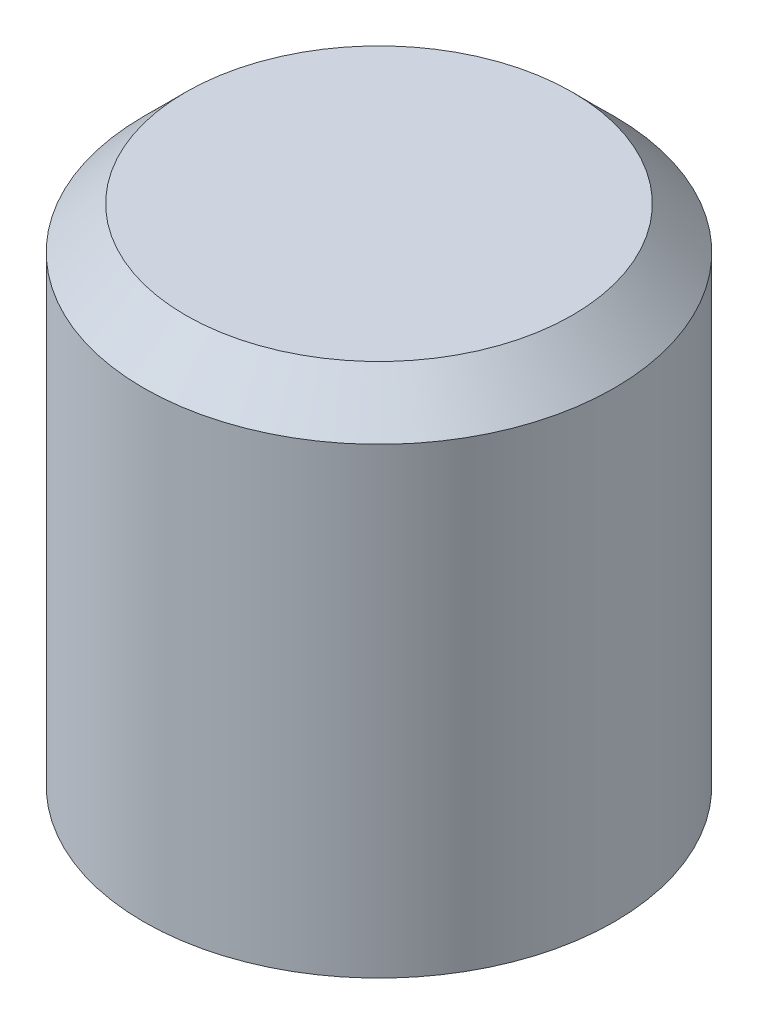
ISO-10303-21;
HEADER;
FILE_DESCRIPTION(('STEP AP214'),'2;1');
FILE_NAME('part.step','',(''),(''),'','','');
FILE_SCHEMA(('AUTOMOTIVE_DESIGN { 1 0 10303 214 1 1 1 1 }'));
ENDSEC;
DATA;
#1=APPLICATION_CONTEXT('core data for automotive mechanical design processes');
#2=APPLICATION_PROTOCOL_DEFINITION('international standard','automotive_design',2000,#1);
#3=PRODUCT_CONTEXT('',#1,'mechanical');
#4=PRODUCT('Part','Part','',(#3));
#5=PRODUCT_RELATED_PRODUCT_CATEGORY('part','',(#4));
#6=PRODUCT_DEFINITION_FORMATION('','',#4);
#7=PRODUCT_DEFINITION_CONTEXT('part definition',#1,'design');
#8=PRODUCT_DEFINITION('design','',#6,#7);
#9=PRODUCT_DEFINITION_SHAPE('','',#8);
#10=(LENGTH_UNIT() NAMED_UNIT(*) SI_UNIT(.MILLI.,.METRE.));
#11=(NAMED_UNIT(*) PLANE_ANGLE_UNIT() SI_UNIT($,.RADIAN.));
#12=(NAMED_UNIT(*) SI_UNIT($,.STERADIAN.) SOLID_ANGLE_UNIT());
#13=UNCERTAINTY_MEASURE_WITH_UNIT(LENGTH_MEASURE(1.E-05),#10,'distance_accuracy_value','');
#14=(GEOMETRIC_REPRESENTATION_CONTEXT(3) GLOBAL_UNCERTAINTY_ASSIGNED_CONTEXT((#13)) GLOBAL_UNIT_ASSIGNED_CONTEXT((#10,
#11,#12)) REPRESENTATION_CONTEXT('',''));
#15=CARTESIAN_POINT('',(0.,0.,0.));
#16=DIRECTION('',(0.,0.,1.));
#17=DIRECTION('',(1.,0.,0.));
#18=AXIS2_PLACEMENT_3D('',#15,#16,#17);
#19=CARTESIAN_POINT('',(0.,3.,0.));
#20=DIRECTION('',(0.,-1.,0.));
#21=DIRECTION('',(0.,0.,-1.));
#22=AXIS2_PLACEMENT_3D('',#19,#20,#21);
#23=CYLINDRICAL_SURFACE('',#22,1.4);
#24=CARTESIAN_POINT('',(0.,2.75,0.));
#25=DIRECTION('',(0.,1.,0.));
#26=DIRECTION('',(0.,0.,1.));
#27=AXIS2_PLACEMENT_3D('',#24,#25,#26);
#28=CIRCLE('',#27,1.4);
#29=CARTESIAN_POINT('',(0.,2.75,1.4));
#30=VERTEX_POINT('',#29);
#31=EDGE_CURVE('E10',#30,#30,#28,.F.);
#32=ORIENTED_EDGE('',*,*,#31,.T.);
#33=EDGE_LOOP('',(#32));
#34=FACE_BOUND('',#33,.T.);
#35=CARTESIAN_POINT('',(0.,0.,0.));
#36=DIRECTION('',(0.,1.,0.));
#37=DIRECTION('',(0.,0.,1.));
#38=AXIS2_PLACEMENT_3D('',#35,#36,#37);
#39=CIRCLE('',#38,1.4);
#40=CARTESIAN_POINT('',(0.,0.,1.4));
#41=VERTEX_POINT('',#40);
#42=EDGE_CURVE('E57',#41,#41,#39,.T.);
#43=ORIENTED_EDGE('',*,*,#42,.T.);
#44=EDGE_LOOP('',(#43));
#45=FACE_BOUND('',#44,.T.);
#46=ADVANCED_FACE('F43',(#34,#45),#23,.T.);
#47=CARTESIAN_POINT('',(0.,3.,0.));
#48=DIRECTION('',(0.,1.,0.));
#49=DIRECTION('',(0.,0.,1.));
#50=AXIS2_PLACEMENT_3D('',#47,#48,#49);
#51=PLANE('',#50);
#52=CARTESIAN_POINT('',(0.,3.,0.));
#53=DIRECTION('',(0.,1.,0.));
#54=DIRECTION('',(0.,0.,1.));
#55=AXIS2_PLACEMENT_3D('',#52,#53,#54);
#56=CIRCLE('',#55,1.15);
#57=CARTESIAN_POINT('',(0.,3.,1.15));
#58=VERTEX_POINT('',#57);
#59=EDGE_CURVE('E52',#58,#58,#56,.T.);
#60=ORIENTED_EDGE('',*,*,#59,.T.);
#61=EDGE_LOOP('',(#60));
#62=FACE_BOUND('',#61,.T.);
#63=ADVANCED_FACE('F68',(#62),#51,.T.);
#64=CARTESIAN_POINT('',(0.,0.,0.));
#65=DIRECTION('',(0.,1.,0.));
#66=DIRECTION('',(0.,0.,1.));
#67=AXIS2_PLACEMENT_3D('',#64,#65,#66);
#68=PLANE('',#67);
#69=ORIENTED_EDGE('',*,*,#42,.F.);
#70=EDGE_LOOP('',(#69));
#71=FACE_BOUND('',#70,.T.);
#72=ADVANCED_FACE('F66',(#71),#68,.F.);
#73=CARTESIAN_POINT('',(0.,3.,0.));
#74=DIRECTION('',(0.,-1.,0.));
#75=DIRECTION('',(0.,0.,-1.));
#76=AXIS2_PLACEMENT_3D('',#73,#74,#75);
#77=CONICAL_SURFACE('',#76,1.15,0.785398163397448);
#78=ORIENTED_EDGE('',*,*,#31,.F.);
#79=EDGE_LOOP('',(#78));
#80=FACE_BOUND('',#79,.T.);
#81=ORIENTED_EDGE('',*,*,#59,.F.);
#82=EDGE_LOOP('',(#81));
#83=FACE_BOUND('',#82,.T.);
#84=ADVANCED_FACE('F46',(#80,#83),#77,.T.);
#85=CLOSED_SHELL('',(#46,#63,#72,#84));
#86=MANIFOLD_SOLID_BREP('B2',#85);
#87=ADVANCED_BREP_SHAPE_REPRESENTATION('',(#18,#86),#14);
#88=SHAPE_DEFINITION_REPRESENTATION(#9,#87);
ENDSEC;
END-ISO-10303-21;
